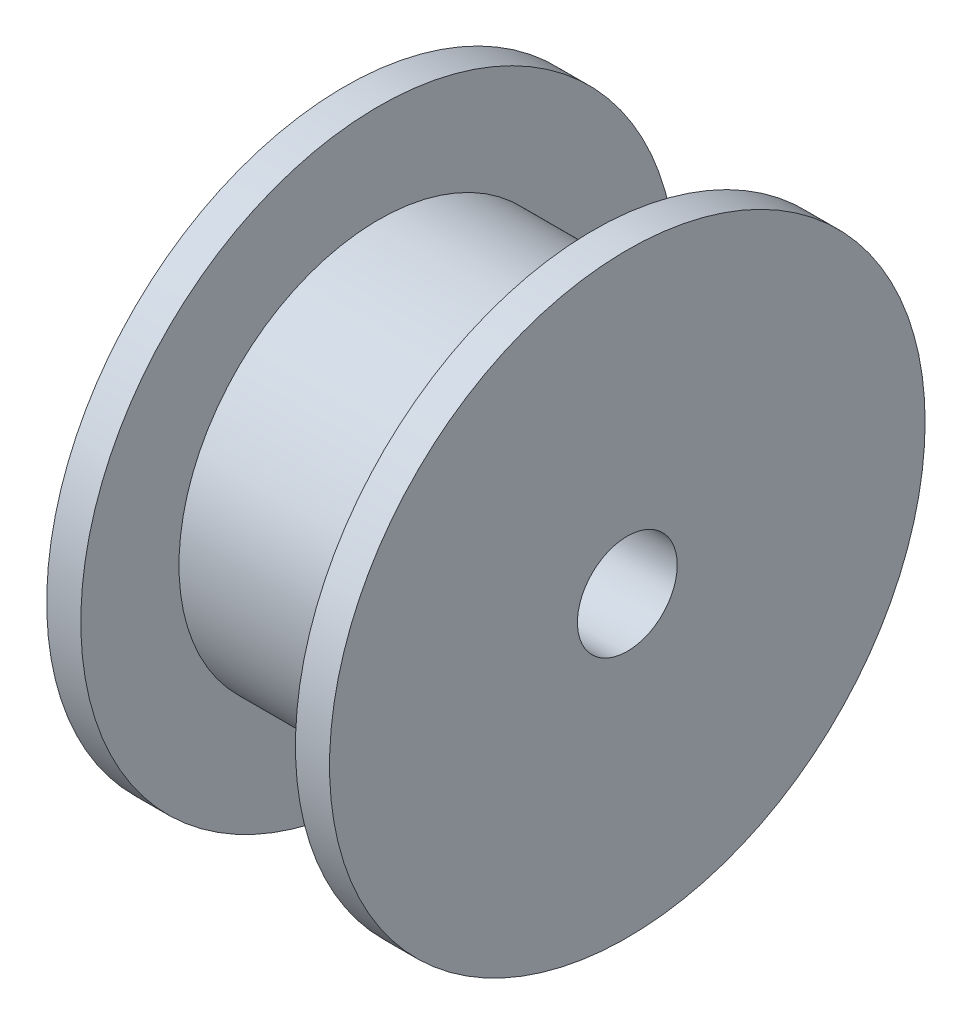
ISO-10303-21;
HEADER;
FILE_DESCRIPTION(('STEP AP214'),'2;1');
FILE_NAME('part.step','',(''),(''),'','','');
FILE_SCHEMA(('AUTOMOTIVE_DESIGN { 1 0 10303 214 1 1 1 1 }'));
ENDSEC;
DATA;
#1=APPLICATION_CONTEXT('core data for automotive mechanical design processes');
#2=APPLICATION_PROTOCOL_DEFINITION('international standard','automotive_design',2000,#1);
#3=PRODUCT_CONTEXT('',#1,'mechanical');
#4=PRODUCT('Part','Part','',(#3));
#5=PRODUCT_RELATED_PRODUCT_CATEGORY('part','',(#4));
#6=PRODUCT_DEFINITION_FORMATION('','',#4);
#7=PRODUCT_DEFINITION_CONTEXT('part definition',#1,'design');
#8=PRODUCT_DEFINITION('design','',#6,#7);
#9=PRODUCT_DEFINITION_SHAPE('','',#8);
#10=(LENGTH_UNIT() NAMED_UNIT(*) SI_UNIT(.MILLI.,.METRE.));
#11=(NAMED_UNIT(*) PLANE_ANGLE_UNIT() SI_UNIT($,.RADIAN.));
#12=(NAMED_UNIT(*) SI_UNIT($,.STERADIAN.) SOLID_ANGLE_UNIT());
#13=UNCERTAINTY_MEASURE_WITH_UNIT(LENGTH_MEASURE(1.E-05),#10,'distance_accuracy_value','');
#14=(GEOMETRIC_REPRESENTATION_CONTEXT(3) GLOBAL_UNCERTAINTY_ASSIGNED_CONTEXT((#13)) GLOBAL_UNIT_ASSIGNED_CONTEXT((#10,
#11,#12)) REPRESENTATION_CONTEXT('',''));
#15=CARTESIAN_POINT('',(0.,0.,0.));
#16=DIRECTION('',(0.,0.,1.));
#17=DIRECTION('',(1.,0.,0.));
#18=AXIS2_PLACEMENT_3D('',#15,#16,#17);
#19=CARTESIAN_POINT('',(0.,0.,0.));
#20=DIRECTION('',(1.,0.,0.));
#21=DIRECTION('',(0.,0.,-1.));
#22=AXIS2_PLACEMENT_3D('',#19,#20,#21);
#23=CYLINDRICAL_SURFACE('',#22,1.5);
#24=CARTESIAN_POINT('',(16.7688471723249,0.,0.));
#25=DIRECTION('',(1.,0.,0.));
#26=DIRECTION('',(0.,0.,-1.));
#27=AXIS2_PLACEMENT_3D('',#24,#25,#26);
#28=CIRCLE('',#27,1.5);
#29=CARTESIAN_POINT('',(16.7688471723249,0.,-1.5));
#30=VERTEX_POINT('',#29);
#31=EDGE_CURVE('E10',#30,#30,#28,.T.);
#32=ORIENTED_EDGE('',*,*,#31,.T.);
#33=EDGE_LOOP('',(#32));
#34=FACE_BOUND('',#33,.T.);
#35=CARTESIAN_POINT('',(8.26884717232492,0.,0.));
#36=DIRECTION('',(1.,0.,0.));
#37=DIRECTION('',(0.,0.,-1.));
#38=AXIS2_PLACEMENT_3D('',#35,#36,#37);
#39=CIRCLE('',#38,1.5);
#40=CARTESIAN_POINT('',(8.26884717232492,0.,-1.5));
#41=VERTEX_POINT('',#40);
#42=EDGE_CURVE('E58',#41,#41,#39,.T.);
#43=ORIENTED_EDGE('',*,*,#42,.F.);
#44=EDGE_LOOP('',(#43));
#45=FACE_BOUND('',#44,.T.);
#46=ADVANCED_FACE('F30',(#34,#45),#23,.F.);
#47=CARTESIAN_POINT('',(16.7688471723249,8.95,0.));
#48=DIRECTION('',(1.,0.,0.));
#49=DIRECTION('',(0.,0.,-1.));
#50=AXIS2_PLACEMENT_3D('',#47,#48,#49);
#51=PLANE('',#50);
#52=CARTESIAN_POINT('',(16.7688471723249,0.,0.));
#53=DIRECTION('',(1.,0.,0.));
#54=DIRECTION('',(0.,0.,-1.));
#55=AXIS2_PLACEMENT_3D('',#52,#53,#54);
#56=CIRCLE('',#55,8.95);
#57=CARTESIAN_POINT('',(16.7688471723249,0.,-8.95));
#58=VERTEX_POINT('',#57);
#59=EDGE_CURVE('E36',#58,#58,#56,.T.);
#60=ORIENTED_EDGE('',*,*,#59,.T.);
#61=EDGE_LOOP('',(#60));
#62=FACE_BOUND('',#61,.T.);
#63=ORIENTED_EDGE('',*,*,#31,.F.);
#64=EDGE_LOOP('',(#63));
#65=FACE_BOUND('',#64,.T.);
#66=ADVANCED_FACE('F66',(#62,#65),#51,.T.);
#67=CARTESIAN_POINT('',(0.,0.,0.));
#68=DIRECTION('',(1.,0.,0.));
#69=DIRECTION('',(0.,0.,-1.));
#70=AXIS2_PLACEMENT_3D('',#67,#68,#69);
#71=CYLINDRICAL_SURFACE('',#70,8.95);
#72=CARTESIAN_POINT('',(15.7438471723249,0.,0.));
#73=DIRECTION('',(1.,0.,0.));
#74=DIRECTION('',(0.,0.,-1.));
#75=AXIS2_PLACEMENT_3D('',#72,#73,#74);
#76=CIRCLE('',#75,8.95);
#77=CARTESIAN_POINT('',(15.7438471723249,0.,-8.95));
#78=VERTEX_POINT('',#77);
#79=EDGE_CURVE('E40',#78,#78,#76,.T.);
#80=ORIENTED_EDGE('',*,*,#79,.T.);
#81=EDGE_LOOP('',(#80));
#82=FACE_BOUND('',#81,.T.);
#83=ORIENTED_EDGE('',*,*,#59,.F.);
#84=EDGE_LOOP('',(#83));
#85=FACE_BOUND('',#84,.T.);
#86=ADVANCED_FACE('F70',(#82,#85),#71,.T.);
#87=CARTESIAN_POINT('',(15.7438471723249,6.,0.));
#88=DIRECTION('',(-1.,0.,0.));
#89=DIRECTION('',(0.,0.,1.));
#90=AXIS2_PLACEMENT_3D('',#87,#88,#89);
#91=PLANE('',#90);
#92=CARTESIAN_POINT('',(15.7438471723249,0.,0.));
#93=DIRECTION('',(1.,0.,0.));
#94=DIRECTION('',(0.,0.,-1.));
#95=AXIS2_PLACEMENT_3D('',#92,#93,#94);
#96=CIRCLE('',#95,6.);
#97=CARTESIAN_POINT('',(15.7438471723249,0.,-6.));
#98=VERTEX_POINT('',#97);
#99=EDGE_CURVE('E44',#98,#98,#96,.T.);
#100=ORIENTED_EDGE('',*,*,#99,.T.);
#101=EDGE_LOOP('',(#100));
#102=FACE_BOUND('',#101,.T.);
#103=ORIENTED_EDGE('',*,*,#79,.F.);
#104=EDGE_LOOP('',(#103));
#105=FACE_BOUND('',#104,.T.);
#106=ADVANCED_FACE('F74',(#102,#105),#91,.T.);
#107=CARTESIAN_POINT('',(0.,0.,0.));
#108=DIRECTION('',(1.,0.,0.));
#109=DIRECTION('',(0.,0.,-1.));
#110=AXIS2_PLACEMENT_3D('',#107,#108,#109);
#111=CYLINDRICAL_SURFACE('',#110,6.);
#112=CARTESIAN_POINT('',(9.29384717232492,0.,0.));
#113=DIRECTION('',(1.,0.,0.));
#114=DIRECTION('',(0.,0.,-1.));
#115=AXIS2_PLACEMENT_3D('',#112,#113,#114);
#116=CIRCLE('',#115,6.);
#117=CARTESIAN_POINT('',(9.29384717232492,0.,-6.));
#118=VERTEX_POINT('',#117);
#119=EDGE_CURVE('E49',#118,#118,#116,.T.);
#120=ORIENTED_EDGE('',*,*,#119,.T.);
#121=EDGE_LOOP('',(#120));
#122=FACE_BOUND('',#121,.T.);
#123=ORIENTED_EDGE('',*,*,#99,.F.);
#124=EDGE_LOOP('',(#123));
#125=FACE_BOUND('',#124,.T.);
#126=ADVANCED_FACE('F81',(#122,#125),#111,.T.);
#127=CARTESIAN_POINT('',(9.29384717232492,8.95,0.));
#128=DIRECTION('',(1.,0.,0.));
#129=DIRECTION('',(0.,0.,-1.));
#130=AXIS2_PLACEMENT_3D('',#127,#128,#129);
#131=PLANE('',#130);
#132=CARTESIAN_POINT('',(9.29384717232492,0.,0.));
#133=DIRECTION('',(1.,0.,0.));
#134=DIRECTION('',(0.,0.,-1.));
#135=AXIS2_PLACEMENT_3D('',#132,#133,#134);
#136=CIRCLE('',#135,8.95);
#137=CARTESIAN_POINT('',(9.29384717232492,0.,-8.95));
#138=VERTEX_POINT('',#137);
#139=EDGE_CURVE('E52',#138,#138,#136,.T.);
#140=ORIENTED_EDGE('',*,*,#139,.T.);
#141=EDGE_LOOP('',(#140));
#142=FACE_BOUND('',#141,.T.);
#143=ORIENTED_EDGE('',*,*,#119,.F.);
#144=EDGE_LOOP('',(#143));
#145=FACE_BOUND('',#144,.T.);
#146=ADVANCED_FACE('F85',(#142,#145),#131,.T.);
#147=CARTESIAN_POINT('',(0.,0.,0.));
#148=DIRECTION('',(1.,0.,0.));
#149=DIRECTION('',(0.,0.,-1.));
#150=AXIS2_PLACEMENT_3D('',#147,#148,#149);
#151=CYLINDRICAL_SURFACE('',#150,8.95);
#152=CARTESIAN_POINT('',(8.26884717232492,0.,0.));
#153=DIRECTION('',(1.,0.,0.));
#154=DIRECTION('',(0.,0.,-1.));
#155=AXIS2_PLACEMENT_3D('',#152,#153,#154);
#156=CIRCLE('',#155,8.95);
#157=CARTESIAN_POINT('',(8.26884717232492,0.,-8.95));
#158=VERTEX_POINT('',#157);
#159=EDGE_CURVE('E55',#158,#158,#156,.T.);
#160=ORIENTED_EDGE('',*,*,#159,.T.);
#161=EDGE_LOOP('',(#160));
#162=FACE_BOUND('',#161,.T.);
#163=ORIENTED_EDGE('',*,*,#139,.F.);
#164=EDGE_LOOP('',(#163));
#165=FACE_BOUND('',#164,.T.);
#166=ADVANCED_FACE('F89',(#162,#165),#151,.T.);
#167=CARTESIAN_POINT('',(8.26884717232492,8.95,0.));
#168=DIRECTION('',(-1.,0.,0.));
#169=DIRECTION('',(0.,0.,1.));
#170=AXIS2_PLACEMENT_3D('',#167,#168,#169);
#171=PLANE('',#170);
#172=ORIENTED_EDGE('',*,*,#42,.T.);
#173=EDGE_LOOP('',(#172));
#174=FACE_BOUND('',#173,.T.);
#175=ORIENTED_EDGE('',*,*,#159,.F.);
#176=EDGE_LOOP('',(#175));
#177=FACE_BOUND('',#176,.T.);
#178=ADVANCED_FACE('F62',(#174,#177),#171,.T.);
#179=CLOSED_SHELL('',(#46,#66,#86,#106,#126,#146,#166,#178));
#180=MANIFOLD_SOLID_BREP('B2',#179);
#181=ADVANCED_BREP_SHAPE_REPRESENTATION('',(#18,#180),#14);
#182=SHAPE_DEFINITION_REPRESENTATION(#9,#181);
ENDSEC;
END-ISO-10303-21;
